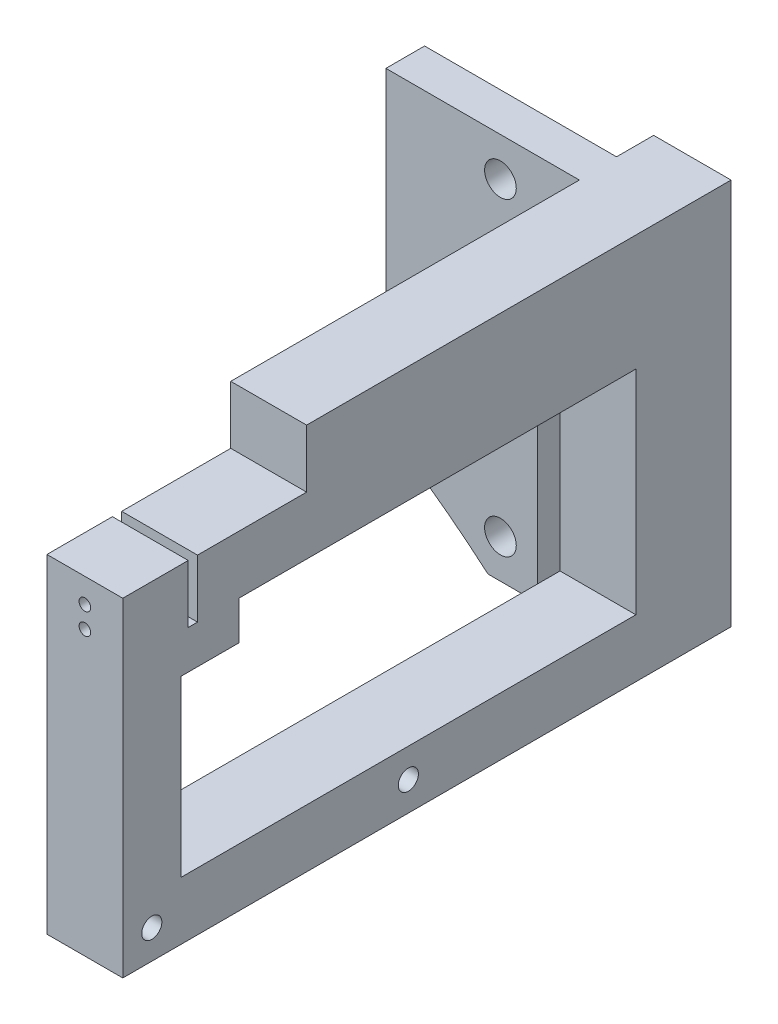
ISO-10303-21;
HEADER;
FILE_DESCRIPTION(('STEP AP214'),'2;1');
FILE_NAME('part.step','',(''),(''),'','','');
FILE_SCHEMA(('AUTOMOTIVE_DESIGN { 1 0 10303 214 1 1 1 1 }'));
ENDSEC;
DATA;
#1=APPLICATION_CONTEXT('core data for automotive mechanical design processes');
#2=APPLICATION_PROTOCOL_DEFINITION('international standard','automotive_design',2000,#1);
#3=PRODUCT_CONTEXT('',#1,'mechanical');
#4=PRODUCT('Part','Part','',(#3));
#5=PRODUCT_RELATED_PRODUCT_CATEGORY('part','',(#4));
#6=PRODUCT_DEFINITION_FORMATION('','',#4);
#7=PRODUCT_DEFINITION_CONTEXT('part definition',#1,'design');
#8=PRODUCT_DEFINITION('design','',#6,#7);
#9=PRODUCT_DEFINITION_SHAPE('','',#8);
#10=(LENGTH_UNIT() NAMED_UNIT(*) SI_UNIT(.MILLI.,.METRE.));
#11=(NAMED_UNIT(*) PLANE_ANGLE_UNIT() SI_UNIT($,.RADIAN.));
#12=(NAMED_UNIT(*) SI_UNIT($,.STERADIAN.) SOLID_ANGLE_UNIT());
#13=UNCERTAINTY_MEASURE_WITH_UNIT(LENGTH_MEASURE(1.E-05),#10,'distance_accuracy_value','');
#14=(GEOMETRIC_REPRESENTATION_CONTEXT(3) GLOBAL_UNCERTAINTY_ASSIGNED_CONTEXT((#13)) GLOBAL_UNIT_ASSIGNED_CONTEXT((#10,
#11,#12)) REPRESENTATION_CONTEXT('',''));
#15=CARTESIAN_POINT('',(0.,0.,0.));
#16=DIRECTION('',(0.,0.,1.));
#17=DIRECTION('',(1.,0.,0.));
#18=AXIS2_PLACEMENT_3D('',#15,#16,#17);
#19=CARTESIAN_POINT('',(-1.101953488478,22.225,0.));
#20=DIRECTION('',(0.,-1.,0.));
#21=DIRECTION('',(0.,0.,-1.));
#22=AXIS2_PLACEMENT_3D('',#19,#20,#21);
#23=PLANE('',#22);
#24=DIRECTION('',(-1.,0.,0.));
#25=VECTOR('',#24,1.);
#26=CARTESIAN_POINT('',(114.3,22.225,82.987000002));
#27=LINE('',#26,#25);
#28=CARTESIAN_POINT('',(114.3,22.225,82.987000002));
#29=VERTEX_POINT('',#28);
#30=CARTESIAN_POINT('',(101.854,22.225,82.987000002));
#31=VERTEX_POINT('',#30);
#32=EDGE_CURVE('E276',#29,#31,#27,.T.);
#33=ORIENTED_EDGE('',*,*,#32,.T.);
#34=DIRECTION('',(0.,0.,-1.));
#35=VECTOR('',#34,1.);
#36=CARTESIAN_POINT('',(101.854,22.225,0.));
#37=LINE('',#36,#35);
#38=CARTESIAN_POINT('',(101.854,22.225,93.725000002));
#39=VERTEX_POINT('',#38);
#40=EDGE_CURVE('E359',#39,#31,#37,.T.);
#41=ORIENTED_EDGE('',*,*,#40,.F.);
#42=DIRECTION('',(1.,0.,0.));
#43=VECTOR('',#42,1.);
#44=CARTESIAN_POINT('',(-1.101953488478,22.225,93.725000002));
#45=LINE('',#44,#43);
#46=CARTESIAN_POINT('',(114.3,22.225,93.725000002));
#47=VERTEX_POINT('',#46);
#48=EDGE_CURVE('E319',#39,#47,#45,.T.);
#49=ORIENTED_EDGE('',*,*,#48,.T.);
#50=DIRECTION('',(0.,0.,-1.));
#51=VECTOR('',#50,1.);
#52=CARTESIAN_POINT('',(114.3,22.225,0.));
#53=LINE('',#52,#51);
#54=EDGE_CURVE('E332',#47,#29,#53,.T.);
#55=ORIENTED_EDGE('',*,*,#54,.T.);
#56=EDGE_LOOP('',(#33,#41,#49,#55));
#57=FACE_BOUND('',#56,.T.);
#58=ADVANCED_FACE('F81',(#57),#23,.F.);
#59=CARTESIAN_POINT('',(-1.101953488478,12.7,0.));
#60=DIRECTION('',(0.,1.,0.));
#61=DIRECTION('',(0.,0.,1.));
#62=AXIS2_PLACEMENT_3D('',#59,#60,#61);
#63=PLANE('',#62);
#64=DIRECTION('',(1.,0.,0.));
#65=VECTOR('',#64,1.);
#66=CARTESIAN_POINT('',(-1.14790309600737,12.7,74.675000002));
#67=LINE('',#66,#65);
#68=CARTESIAN_POINT('',(101.854,12.7,74.675000002));
#69=VERTEX_POINT('',#68);
#70=CARTESIAN_POINT('',(114.3,12.7,74.675000002));
#71=VERTEX_POINT('',#70);
#72=EDGE_CURVE('E290',#69,#71,#67,.T.);
#73=ORIENTED_EDGE('',*,*,#72,.F.);
#74=DIRECTION('',(0.,0.,1.));
#75=VECTOR('',#74,1.);
#76=CARTESIAN_POINT('',(101.854,12.7,0.));
#77=LINE('',#76,#75);
#78=CARTESIAN_POINT('',(101.854,12.7,9.525));
#79=VERTEX_POINT('',#78);
#80=EDGE_CURVE('E352',#79,#69,#77,.T.);
#81=ORIENTED_EDGE('',*,*,#80,.F.);
#82=DIRECTION('',(1.,0.,0.));
#83=VECTOR('',#82,1.);
#84=CARTESIAN_POINT('',(-1.101953488478,12.7,9.525));
#85=LINE('',#84,#83);
#86=CARTESIAN_POINT('',(114.3,12.7,9.525));
#87=VERTEX_POINT('',#86);
#88=EDGE_CURVE('E340',#79,#87,#85,.T.);
#89=ORIENTED_EDGE('',*,*,#88,.T.);
#90=DIRECTION('',(0.,0.,1.));
#91=VECTOR('',#90,1.);
#92=CARTESIAN_POINT('',(114.3,12.7,0.));
#93=LINE('',#92,#91);
#94=EDGE_CURVE('E336',#87,#71,#93,.T.);
#95=ORIENTED_EDGE('',*,*,#94,.T.);
#96=EDGE_LOOP('',(#73,#81,#89,#95));
#97=FACE_BOUND('',#96,.T.);
#98=ADVANCED_FACE('F560',(#97),#63,.F.);
#99=CARTESIAN_POINT('',(0.,-132.08,6.35));
#100=DIRECTION('',(0.,0.,1.));
#101=DIRECTION('',(1.,0.,0.));
#102=AXIS2_PLACEMENT_3D('',#99,#100,#101);
#103=PLANE('',#102);
#104=CARTESIAN_POINT('',(88.9,-25.4,6.35));
#105=DIRECTION('',(0.,0.,1.));
#106=DIRECTION('',(1.,0.,0.));
#107=AXIS2_PLACEMENT_3D('',#104,#105,#106);
#108=CIRCLE('',#107,2.600000007);
#109=CARTESIAN_POINT('',(91.500000007,-25.4,6.35));
#110=VERTEX_POINT('',#109);
#111=EDGE_CURVE('E410',#110,#110,#108,.T.);
#112=ORIENTED_EDGE('',*,*,#111,.F.);
#113=EDGE_LOOP('',(#112));
#114=FACE_BOUND('',#113,.T.);
#115=CARTESIAN_POINT('',(88.9,25.4,6.35));
#116=DIRECTION('',(0.,0.,1.));
#117=DIRECTION('',(1.,0.,0.));
#118=AXIS2_PLACEMENT_3D('',#115,#116,#117);
#119=CIRCLE('',#118,2.600000007);
#120=CARTESIAN_POINT('',(91.500000007,25.4,6.35));
#121=VERTEX_POINT('',#120);
#122=EDGE_CURVE('E404',#121,#121,#119,.T.);
#123=ORIENTED_EDGE('',*,*,#122,.F.);
#124=EDGE_LOOP('',(#123));
#125=FACE_BOUND('',#124,.T.);
#126=DIRECTION('',(1.,0.,0.));
#127=VECTOR('',#126,1.);
#128=CARTESIAN_POINT('',(94.996,22.479,6.35));
#129=LINE('',#128,#127);
#130=CARTESIAN_POINT('',(94.996,22.479,6.35));
#131=VERTEX_POINT('',#130);
#132=CARTESIAN_POINT('',(101.854,22.479,6.35));
#133=VERTEX_POINT('',#132);
#134=EDGE_CURVE('E427',#131,#133,#129,.T.);
#135=ORIENTED_EDGE('',*,*,#134,.T.);
#136=DIRECTION('',(0.,-1.,0.));
#137=VECTOR('',#136,1.);
#138=CARTESIAN_POINT('',(101.854,90.3006026653769,6.35));
#139=LINE('',#138,#137);
#140=CARTESIAN_POINT('',(101.854,31.75,6.35));
#141=VERTEX_POINT('',#140);
#142=EDGE_CURVE('E322',#141,#133,#139,.T.);
#143=ORIENTED_EDGE('',*,*,#142,.F.);
#144=DIRECTION('',(-1.,0.,0.));
#145=VECTOR('',#144,1.);
#146=CARTESIAN_POINT('',(70.104,31.75,6.35));
#147=LINE('',#146,#145);
#148=CARTESIAN_POINT('',(70.104,31.75,6.35));
#149=VERTEX_POINT('',#148);
#150=EDGE_CURVE('E416',#141,#149,#147,.T.);
#151=ORIENTED_EDGE('',*,*,#150,.T.);
#152=DIRECTION('',(0.,-1.,0.));
#153=VECTOR('',#152,1.);
#154=CARTESIAN_POINT('',(70.104,22.225,6.35));
#155=LINE('',#154,#153);
#156=CARTESIAN_POINT('',(70.104,-19.4100401501921,6.35));
#157=VERTEX_POINT('',#156);
#158=EDGE_CURVE('E418',#149,#157,#155,.T.);
#159=ORIENTED_EDGE('',*,*,#158,.T.);
#160=CARTESIAN_POINT('',(0.,-132.08,6.35));
#161=DIRECTION('',(0.,0.,-1.));
#162=DIRECTION('',(1.,0.,0.));
#163=AXIS2_PLACEMENT_3D('',#160,#161,#162);
#164=CIRCLE('',#163,132.699248937427);
#165=CARTESIAN_POINT('',(86.8503412115192,-31.75,6.35));
#166=VERTEX_POINT('',#165);
#167=EDGE_CURVE('E421',#157,#166,#164,.T.);
#168=ORIENTED_EDGE('',*,*,#167,.T.);
#169=DIRECTION('',(1.,0.,0.));
#170=VECTOR('',#169,1.);
#171=CARTESIAN_POINT('',(94.996,-31.75,6.35));
#172=LINE('',#171,#170);
#173=CARTESIAN_POINT('',(94.996,-31.75,6.35));
#174=VERTEX_POINT('',#173);
#175=EDGE_CURVE('E423',#166,#174,#172,.T.);
#176=ORIENTED_EDGE('',*,*,#175,.T.);
#177=DIRECTION('',(0.,1.,0.));
#178=VECTOR('',#177,1.);
#179=CARTESIAN_POINT('',(94.996,-31.75,6.35));
#180=LINE('',#179,#178);
#181=EDGE_CURVE('E425',#174,#131,#180,.T.);
#182=ORIENTED_EDGE('',*,*,#181,.T.);
#183=EDGE_LOOP('',(#135,#143,#151,#159,#168,#176,#182));
#184=FACE_BOUND('',#183,.T.);
#185=ADVANCED_FACE('F509',(#114,#125,#184),#103,.T.);
#186=CARTESIAN_POINT('',(101.854,22.225,81.463000002));
#187=VERTEX_POINT('',#186);
#188=CARTESIAN_POINT('',(101.854,22.225,63.562500002));
#189=VERTEX_POINT('',#188);
#190=EDGE_CURVE('E362',#187,#189,#37,.T.);
#191=ORIENTED_EDGE('',*,*,#190,.F.);
#192=DIRECTION('',(-1.,0.,0.));
#193=VECTOR('',#192,1.);
#194=CARTESIAN_POINT('',(114.3,22.225,81.463000002));
#195=LINE('',#194,#193);
#196=CARTESIAN_POINT('',(114.3,22.225,81.463000002));
#197=VERTEX_POINT('',#196);
#198=EDGE_CURVE('E273',#197,#187,#195,.T.);
#199=ORIENTED_EDGE('',*,*,#198,.F.);
#200=CARTESIAN_POINT('',(114.3,22.225,63.562500002));
#201=VERTEX_POINT('',#200);
#202=EDGE_CURVE('E264',#197,#201,#53,.T.);
#203=ORIENTED_EDGE('',*,*,#202,.T.);
#204=DIRECTION('',(1.,0.,0.));
#205=VECTOR('',#204,1.);
#206=CARTESIAN_POINT('',(101.854,22.225,63.562500002));
#207=LINE('',#206,#205);
#208=EDGE_CURVE('E312',#189,#201,#207,.T.);
#209=ORIENTED_EDGE('',*,*,#208,.F.);
#210=EDGE_LOOP('',(#191,#199,#203,#209));
#211=FACE_BOUND('',#210,.T.);
#212=ADVANCED_FACE('F506',(#211),#23,.F.);
#213=CARTESIAN_POINT('',(0.,-132.08,0.));
#214=DIRECTION('',(0.,0.,1.));
#215=DIRECTION('',(1.,0.,0.));
#216=AXIS2_PLACEMENT_3D('',#213,#214,#215);
#217=PLANE('',#216);
#218=DIRECTION('',(-1.,0.,0.));
#219=VECTOR('',#218,1.);
#220=CARTESIAN_POINT('',(70.104,31.75,0.));
#221=LINE('',#220,#219);
#222=CARTESIAN_POINT('',(101.6,31.75,0.));
#223=VERTEX_POINT('',#222);
#224=CARTESIAN_POINT('',(70.104,31.75,0.));
#225=VERTEX_POINT('',#224);
#226=EDGE_CURVE('E413',#223,#225,#221,.T.);
#227=ORIENTED_EDGE('',*,*,#226,.F.);
#228=DIRECTION('',(0.,1.,0.));
#229=VECTOR('',#228,1.);
#230=CARTESIAN_POINT('',(101.6,22.479,0.));
#231=LINE('',#230,#229);
#232=CARTESIAN_POINT('',(101.6,22.479,0.));
#233=VERTEX_POINT('',#232);
#234=EDGE_CURVE('E419',#233,#223,#231,.T.);
#235=ORIENTED_EDGE('',*,*,#234,.F.);
#236=DIRECTION('',(1.,0.,0.));
#237=VECTOR('',#236,1.);
#238=CARTESIAN_POINT('',(94.996,22.479,0.));
#239=LINE('',#238,#237);
#240=CARTESIAN_POINT('',(94.996,22.479,0.));
#241=VERTEX_POINT('',#240);
#242=EDGE_CURVE('E441',#241,#233,#239,.T.);
#243=ORIENTED_EDGE('',*,*,#242,.F.);
#244=DIRECTION('',(0.,1.,0.));
#245=VECTOR('',#244,1.);
#246=CARTESIAN_POINT('',(94.996,-31.75,0.));
#247=LINE('',#246,#245);
#248=CARTESIAN_POINT('',(94.996,-31.75,0.));
#249=VERTEX_POINT('',#248);
#250=EDGE_CURVE('E439',#249,#241,#247,.T.);
#251=ORIENTED_EDGE('',*,*,#250,.F.);
#252=DIRECTION('',(1.,0.,0.));
#253=VECTOR('',#252,1.);
#254=CARTESIAN_POINT('',(94.996,-31.75,0.));
#255=LINE('',#254,#253);
#256=CARTESIAN_POINT('',(86.8503412115192,-31.75,0.));
#257=VERTEX_POINT('',#256);
#258=EDGE_CURVE('E437',#257,#249,#255,.T.);
#259=ORIENTED_EDGE('',*,*,#258,.F.);
#260=CARTESIAN_POINT('',(0.,-132.08,0.));
#261=DIRECTION('',(0.,0.,-1.));
#262=DIRECTION('',(1.,0.,0.));
#263=AXIS2_PLACEMENT_3D('',#260,#261,#262);
#264=CIRCLE('',#263,132.699248937427);
#265=CARTESIAN_POINT('',(70.104,-19.4100401501921,0.));
#266=VERTEX_POINT('',#265);
#267=EDGE_CURVE('E435',#266,#257,#264,.T.);
#268=ORIENTED_EDGE('',*,*,#267,.F.);
#269=DIRECTION('',(0.,-1.,0.));
#270=VECTOR('',#269,1.);
#271=CARTESIAN_POINT('',(70.104,-19.2523962473841,0.));
#272=LINE('',#271,#270);
#273=EDGE_CURVE('E433',#225,#266,#272,.T.);
#274=ORIENTED_EDGE('',*,*,#273,.F.);
#275=EDGE_LOOP('',(#227,#235,#243,#251,#259,#268,#274));
#276=FACE_BOUND('',#275,.T.);
#277=CARTESIAN_POINT('',(88.9,-25.4,0.));
#278=DIRECTION('',(0.,0.,1.));
#279=DIRECTION('',(1.,0.,0.));
#280=AXIS2_PLACEMENT_3D('',#277,#278,#279);
#281=CIRCLE('',#280,2.600000007);
#282=CARTESIAN_POINT('',(91.500000007,-25.4,0.));
#283=VERTEX_POINT('',#282);
#284=EDGE_CURVE('E407',#283,#283,#281,.T.);
#285=ORIENTED_EDGE('',*,*,#284,.T.);
#286=EDGE_LOOP('',(#285));
#287=FACE_BOUND('',#286,.T.);
#288=CARTESIAN_POINT('',(88.9,25.4,0.));
#289=DIRECTION('',(0.,0.,1.));
#290=DIRECTION('',(1.,0.,0.));
#291=AXIS2_PLACEMENT_3D('',#288,#289,#290);
#292=CIRCLE('',#291,2.600000007);
#293=CARTESIAN_POINT('',(91.500000007,25.4,0.));
#294=VERTEX_POINT('',#293);
#295=EDGE_CURVE('E403',#294,#294,#292,.T.);
#296=ORIENTED_EDGE('',*,*,#295,.T.);
#297=EDGE_LOOP('',(#296));
#298=FACE_BOUND('',#297,.T.);
#299=ADVANCED_FACE('F539',(#276,#287,#298),#217,.F.);
#300=CARTESIAN_POINT('',(70.104,31.75,6.35));
#301=DIRECTION('',(0.,-1.,0.));
#302=DIRECTION('',(0.,0.,-1.));
#303=AXIS2_PLACEMENT_3D('',#300,#301,#302);
#304=PLANE('',#303);
#305=ORIENTED_EDGE('',*,*,#150,.F.);
#306=DIRECTION('',(0.,0.,-1.));
#307=VECTOR('',#306,1.);
#308=CARTESIAN_POINT('',(101.854,31.75,6.35));
#309=LINE('',#308,#307);
#310=CARTESIAN_POINT('',(101.854,31.75,63.562500002));
#311=VERTEX_POINT('',#310);
#312=EDGE_CURVE('E316',#311,#141,#309,.T.);
#313=ORIENTED_EDGE('',*,*,#312,.F.);
#314=DIRECTION('',(-1.,0.,0.));
#315=VECTOR('',#314,1.);
#316=CARTESIAN_POINT('',(101.854,31.75,63.562500002));
#317=LINE('',#316,#315);
#318=CARTESIAN_POINT('',(114.3,31.75,63.562500002));
#319=VERTEX_POINT('',#318);
#320=EDGE_CURVE('E313',#319,#311,#317,.T.);
#321=ORIENTED_EDGE('',*,*,#320,.F.);
#322=DIRECTION('',(0.,0.,1.));
#323=VECTOR('',#322,1.);
#324=CARTESIAN_POINT('',(114.3,31.75,-71.1075478226285));
#325=LINE('',#324,#323);
#326=CARTESIAN_POINT('',(114.3,31.75,-6.09600000000007));
#327=VERTEX_POINT('',#326);
#328=EDGE_CURVE('E384',#327,#319,#325,.T.);
#329=ORIENTED_EDGE('',*,*,#328,.F.);
#330=DIRECTION('',(-1.,0.,0.));
#331=VECTOR('',#330,1.);
#332=CARTESIAN_POINT('',(114.3,31.75,-6.09600000000007));
#333=LINE('',#332,#331);
#334=CARTESIAN_POINT('',(101.6,31.75,-6.09600000000006));
#335=VERTEX_POINT('',#334);
#336=EDGE_CURVE('E382',#327,#335,#333,.T.);
#337=ORIENTED_EDGE('',*,*,#336,.T.);
#338=DIRECTION('',(0.,0.,1.));
#339=VECTOR('',#338,1.);
#340=CARTESIAN_POINT('',(101.6,31.75,-71.1075478226285));
#341=LINE('',#340,#339);
#342=EDGE_CURVE('E381',#335,#223,#341,.T.);
#343=ORIENTED_EDGE('',*,*,#342,.T.);
#344=ORIENTED_EDGE('',*,*,#226,.T.);
#345=DIRECTION('',(0.,0.,-1.));
#346=VECTOR('',#345,1.);
#347=CARTESIAN_POINT('',(70.104,31.75,6.35));
#348=LINE('',#347,#346);
#349=EDGE_CURVE('E13',#149,#225,#348,.T.);
#350=ORIENTED_EDGE('',*,*,#349,.F.);
#351=EDGE_LOOP('',(#305,#313,#321,#329,#337,#343,#344,#350));
#352=FACE_BOUND('',#351,.T.);
#353=ADVANCED_FACE('F83',(#352),#304,.F.);
#354=CARTESIAN_POINT('',(70.104,-19.2523962473841,6.35));
#355=DIRECTION('',(1.,0.,0.));
#356=DIRECTION('',(0.,1.,0.));
#357=AXIS2_PLACEMENT_3D('',#354,#355,#356);
#358=PLANE('',#357);
#359=ORIENTED_EDGE('',*,*,#273,.T.);
#360=DIRECTION('',(0.,0.,-1.));
#361=VECTOR('',#360,1.);
#362=CARTESIAN_POINT('',(70.104,-19.4100401501921,6.35));
#363=LINE('',#362,#361);
#364=EDGE_CURVE('E90',#157,#266,#363,.T.);
#365=ORIENTED_EDGE('',*,*,#364,.F.);
#366=ORIENTED_EDGE('',*,*,#158,.F.);
#367=ORIENTED_EDGE('',*,*,#349,.T.);
#368=EDGE_LOOP('',(#359,#365,#366,#367));
#369=FACE_BOUND('',#368,.T.);
#370=ADVANCED_FACE('F514',(#369),#358,.F.);
#371=CARTESIAN_POINT('',(0.,-132.08,6.35));
#372=DIRECTION('',(0.,0.,-1.));
#373=DIRECTION('',(-1.,0.,0.));
#374=AXIS2_PLACEMENT_3D('',#371,#372,#373);
#375=CYLINDRICAL_SURFACE('',#374,132.699248937427);
#376=ORIENTED_EDGE('',*,*,#267,.T.);
#377=DIRECTION('',(0.,0.,-1.));
#378=VECTOR('',#377,1.);
#379=CARTESIAN_POINT('',(86.8503412115192,-31.75,6.35));
#380=LINE('',#379,#378);
#381=EDGE_CURVE('E450',#166,#257,#380,.T.);
#382=ORIENTED_EDGE('',*,*,#381,.F.);
#383=ORIENTED_EDGE('',*,*,#167,.F.);
#384=ORIENTED_EDGE('',*,*,#364,.T.);
#385=EDGE_LOOP('',(#376,#382,#383,#384));
#386=FACE_BOUND('',#385,.T.);
#387=ADVANCED_FACE('F521',(#386),#375,.F.);
#388=CARTESIAN_POINT('',(94.996,-31.75,6.35));
#389=DIRECTION('',(0.,1.,0.));
#390=DIRECTION('',(0.,0.,1.));
#391=AXIS2_PLACEMENT_3D('',#388,#389,#390);
#392=PLANE('',#391);
#393=ORIENTED_EDGE('',*,*,#258,.T.);
#394=DIRECTION('',(0.,0.,-1.));
#395=VECTOR('',#394,1.);
#396=CARTESIAN_POINT('',(94.996,-31.75,6.35));
#397=LINE('',#396,#395);
#398=EDGE_CURVE('E447',#174,#249,#397,.T.);
#399=ORIENTED_EDGE('',*,*,#398,.F.);
#400=ORIENTED_EDGE('',*,*,#175,.F.);
#401=ORIENTED_EDGE('',*,*,#381,.T.);
#402=EDGE_LOOP('',(#393,#399,#400,#401));
#403=FACE_BOUND('',#402,.T.);
#404=ADVANCED_FACE('F525',(#403),#392,.F.);
#405=CARTESIAN_POINT('',(94.996,-31.75,6.35));
#406=DIRECTION('',(-1.,0.,0.));
#407=DIRECTION('',(0.,-1.,0.));
#408=AXIS2_PLACEMENT_3D('',#405,#406,#407);
#409=PLANE('',#408);
#410=ORIENTED_EDGE('',*,*,#250,.T.);
#411=DIRECTION('',(0.,0.,-1.));
#412=VECTOR('',#411,1.);
#413=CARTESIAN_POINT('',(94.996,22.479,6.35));
#414=LINE('',#413,#412);
#415=EDGE_CURVE('E430',#131,#241,#414,.T.);
#416=ORIENTED_EDGE('',*,*,#415,.F.);
#417=ORIENTED_EDGE('',*,*,#181,.F.);
#418=ORIENTED_EDGE('',*,*,#398,.T.);
#419=EDGE_LOOP('',(#410,#416,#417,#418));
#420=FACE_BOUND('',#419,.T.);
#421=ADVANCED_FACE('F530',(#420),#409,.F.);
#422=CARTESIAN_POINT('',(94.996,22.479,6.35));
#423=DIRECTION('',(0.,1.,0.));
#424=DIRECTION('',(0.,0.,1.));
#425=AXIS2_PLACEMENT_3D('',#422,#423,#424);
#426=PLANE('',#425);
#427=ORIENTED_EDGE('',*,*,#242,.T.);
#428=DIRECTION('',(0.,0.,1.));
#429=VECTOR('',#428,1.);
#430=CARTESIAN_POINT('',(101.6,22.479,-71.1075478226285));
#431=LINE('',#430,#429);
#432=CARTESIAN_POINT('',(101.6,22.479,-6.09600000000006));
#433=VERTEX_POINT('',#432);
#434=EDGE_CURVE('E380',#433,#233,#431,.T.);
#435=ORIENTED_EDGE('',*,*,#434,.F.);
#436=DIRECTION('',(1.,0.,0.));
#437=VECTOR('',#436,1.);
#438=CARTESIAN_POINT('',(101.6,22.479,-6.09600000000006));
#439=LINE('',#438,#437);
#440=CARTESIAN_POINT('',(101.854,22.479,-6.09600000000009));
#441=VERTEX_POINT('',#440);
#442=EDGE_CURVE('E351',#433,#441,#439,.T.);
#443=ORIENTED_EDGE('',*,*,#442,.T.);
#444=DIRECTION('',(0.,0.,1.));
#445=VECTOR('',#444,1.);
#446=CARTESIAN_POINT('',(101.854,22.479,-71.1075478226285));
#447=LINE('',#446,#445);
#448=EDGE_CURVE('E376',#441,#133,#447,.T.);
#449=ORIENTED_EDGE('',*,*,#448,.T.);
#450=ORIENTED_EDGE('',*,*,#134,.F.);
#451=ORIENTED_EDGE('',*,*,#415,.T.);
#452=EDGE_LOOP('',(#427,#435,#443,#449,#450,#451));
#453=FACE_BOUND('',#452,.T.);
#454=ADVANCED_FACE('F533',(#453),#426,.F.);
#455=CARTESIAN_POINT('',(88.9,-25.4,6.35));
#456=DIRECTION('',(0.,0.,-1.));
#457=DIRECTION('',(-1.,0.,0.));
#458=AXIS2_PLACEMENT_3D('',#455,#456,#457);
#459=CYLINDRICAL_SURFACE('',#458,2.600000007);
#460=ORIENTED_EDGE('',*,*,#111,.T.);
#461=EDGE_LOOP('',(#460));
#462=FACE_BOUND('',#461,.T.);
#463=ORIENTED_EDGE('',*,*,#284,.F.);
#464=EDGE_LOOP('',(#463));
#465=FACE_BOUND('',#464,.T.);
#466=ADVANCED_FACE('F549',(#462,#465),#459,.F.);
#467=CARTESIAN_POINT('',(88.9,25.4,6.35));
#468=DIRECTION('',(0.,0.,-1.));
#469=DIRECTION('',(-1.,0.,0.));
#470=AXIS2_PLACEMENT_3D('',#467,#468,#469);
#471=CYLINDRICAL_SURFACE('',#470,2.600000007);
#472=ORIENTED_EDGE('',*,*,#122,.T.);
#473=EDGE_LOOP('',(#472));
#474=FACE_BOUND('',#473,.T.);
#475=ORIENTED_EDGE('',*,*,#295,.F.);
#476=EDGE_LOOP('',(#475));
#477=FACE_BOUND('',#476,.T.);
#478=ADVANCED_FACE('F547',(#474,#477),#471,.F.);
#479=CARTESIAN_POINT('',(0.,-120.65,-6.09599999999997));
#480=DIRECTION('',(0.,0.,-1.));
#481=DIRECTION('',(1.,0.,0.));
#482=AXIS2_PLACEMENT_3D('',#479,#480,#481);
#483=PLANE('',#482);
#484=DIRECTION('',(1.,0.,0.));
#485=VECTOR('',#484,1.);
#486=CARTESIAN_POINT('',(101.854,-31.75,-6.09600000000006));
#487=LINE('',#486,#485);
#488=CARTESIAN_POINT('',(101.854,-31.75,-6.09600000000006));
#489=VERTEX_POINT('',#488);
#490=CARTESIAN_POINT('',(114.3,-31.75,-6.09600000000007));
#491=VERTEX_POINT('',#490);
#492=EDGE_CURVE('E388',#489,#491,#487,.T.);
#493=ORIENTED_EDGE('',*,*,#492,.F.);
#494=DIRECTION('',(0.,-1.,0.));
#495=VECTOR('',#494,1.);
#496=CARTESIAN_POINT('',(101.854,22.479,-6.09600000000006));
#497=LINE('',#496,#495);
#498=EDGE_CURVE('E392',#441,#489,#497,.T.);
#499=ORIENTED_EDGE('',*,*,#498,.F.);
#500=ORIENTED_EDGE('',*,*,#442,.F.);
#501=DIRECTION('',(0.,-1.,0.));
#502=VECTOR('',#501,1.);
#503=CARTESIAN_POINT('',(101.6,31.75,-6.09600000000006));
#504=LINE('',#503,#502);
#505=EDGE_CURVE('E377',#335,#433,#504,.T.);
#506=ORIENTED_EDGE('',*,*,#505,.F.);
#507=ORIENTED_EDGE('',*,*,#336,.F.);
#508=DIRECTION('',(0.,1.,0.));
#509=VECTOR('',#508,1.);
#510=CARTESIAN_POINT('',(114.3,-31.75,-6.09600000000007));
#511=LINE('',#510,#509);
#512=EDGE_CURVE('E385',#491,#327,#511,.T.);
#513=ORIENTED_EDGE('',*,*,#512,.F.);
#514=EDGE_LOOP('',(#493,#499,#500,#506,#507,#513));
#515=FACE_BOUND('',#514,.T.);
#516=ADVANCED_FACE('F496',(#515),#483,.T.);
#517=CARTESIAN_POINT('',(101.854,22.479,-71.1075478226285));
#518=DIRECTION('',(-1.,0.,0.));
#519=DIRECTION('',(0.,0.,1.));
#520=AXIS2_PLACEMENT_3D('',#517,#518,#519);
#521=PLANE('',#520);
#522=DIRECTION('',(0.,-1.,0.));
#523=VECTOR('',#522,1.);
#524=CARTESIAN_POINT('',(101.854,22.479,81.463000002));
#525=LINE('',#524,#523);
#526=CARTESIAN_POINT('',(101.854,12.7,81.463000002));
#527=VERTEX_POINT('',#526);
#528=EDGE_CURVE('E258',#187,#527,#525,.T.);
#529=ORIENTED_EDGE('',*,*,#528,.F.);
#530=ORIENTED_EDGE('',*,*,#190,.T.);
#531=DIRECTION('',(0.,-1.,0.));
#532=VECTOR('',#531,1.);
#533=CARTESIAN_POINT('',(101.854,90.3006026653769,63.562500002));
#534=LINE('',#533,#532);
#535=EDGE_CURVE('E317',#311,#189,#534,.T.);
#536=ORIENTED_EDGE('',*,*,#535,.F.);
#537=ORIENTED_EDGE('',*,*,#312,.T.);
#538=ORIENTED_EDGE('',*,*,#142,.T.);
#539=ORIENTED_EDGE('',*,*,#448,.F.);
#540=ORIENTED_EDGE('',*,*,#498,.T.);
#541=DIRECTION('',(0.,0.,1.));
#542=VECTOR('',#541,1.);
#543=CARTESIAN_POINT('',(101.854,-31.75,-71.1075478226285));
#544=LINE('',#543,#542);
#545=CARTESIAN_POINT('',(101.854,-31.75,93.725000002));
#546=VERTEX_POINT('',#545);
#547=EDGE_CURVE('E391',#489,#546,#544,.T.);
#548=ORIENTED_EDGE('',*,*,#547,.T.);
#549=DIRECTION('',(0.,1.,0.));
#550=VECTOR('',#549,1.);
#551=CARTESIAN_POINT('',(101.854,0.,93.725000002));
#552=LINE('',#551,#550);
#553=EDGE_CURVE('E330',#546,#39,#552,.T.);
#554=ORIENTED_EDGE('',*,*,#553,.T.);
#555=ORIENTED_EDGE('',*,*,#40,.T.);
#556=DIRECTION('',(0.,-1.,0.));
#557=VECTOR('',#556,1.);
#558=CARTESIAN_POINT('',(101.854,22.479,82.987000002));
#559=LINE('',#558,#557);
#560=CARTESIAN_POINT('',(101.854,12.7,82.987000002));
#561=VERTEX_POINT('',#560);
#562=EDGE_CURVE('E281',#31,#561,#559,.T.);
#563=ORIENTED_EDGE('',*,*,#562,.T.);
#564=DIRECTION('',(0.,0.,-1.));
#565=VECTOR('',#564,1.);
#566=CARTESIAN_POINT('',(101.854,12.7,-71.1075478226285));
#567=LINE('',#566,#565);
#568=EDGE_CURVE('E275',#561,#527,#567,.T.);
#569=ORIENTED_EDGE('',*,*,#568,.T.);
#570=EDGE_LOOP('',(#529,#530,#536,#537,#538,#539,#540,#548,#554,#555,#563,#569));
#571=FACE_BOUND('',#570,.T.);
#572=DIRECTION('',(0.,0.,-1.));
#573=VECTOR('',#572,1.);
#574=CARTESIAN_POINT('',(101.854,6.35000000000002,0.));
#575=LINE('',#574,#573);
#576=CARTESIAN_POINT('',(101.854,6.35000000000002,84.200000002));
#577=VERTEX_POINT('',#576);
#578=CARTESIAN_POINT('',(101.854,6.35000000000002,74.675000002));
#579=VERTEX_POINT('',#578);
#580=EDGE_CURVE('E292',#577,#579,#575,.T.);
#581=ORIENTED_EDGE('',*,*,#580,.F.);
#582=DIRECTION('',(0.,-1.,0.));
#583=VECTOR('',#582,1.);
#584=CARTESIAN_POINT('',(101.854,0.,84.200000002));
#585=LINE('',#584,#583);
#586=CARTESIAN_POINT('',(101.854,-22.225,84.200000002));
#587=VERTEX_POINT('',#586);
#588=EDGE_CURVE('E349',#577,#587,#585,.T.);
#589=ORIENTED_EDGE('',*,*,#588,.T.);
#590=DIRECTION('',(0.,0.,-1.));
#591=VECTOR('',#590,1.);
#592=CARTESIAN_POINT('',(101.854,-22.225,0.));
#593=LINE('',#592,#591);
#594=CARTESIAN_POINT('',(101.854,-22.225,9.525));
#595=VERTEX_POINT('',#594);
#596=EDGE_CURVE('E358',#587,#595,#593,.T.);
#597=ORIENTED_EDGE('',*,*,#596,.T.);
#598=DIRECTION('',(0.,1.,0.));
#599=VECTOR('',#598,1.);
#600=CARTESIAN_POINT('',(101.854,0.,9.525));
#601=LINE('',#600,#599);
#602=EDGE_CURVE('E355',#595,#79,#601,.T.);
#603=ORIENTED_EDGE('',*,*,#602,.T.);
#604=ORIENTED_EDGE('',*,*,#80,.T.);
#605=DIRECTION('',(0.,-1.,0.));
#606=VECTOR('',#605,1.);
#607=CARTESIAN_POINT('',(101.854,0.,74.675000002));
#608=LINE('',#607,#606);
#609=EDGE_CURVE('E285',#69,#579,#608,.T.);
#610=ORIENTED_EDGE('',*,*,#609,.T.);
#611=EDGE_LOOP('',(#581,#589,#597,#603,#604,#610));
#612=FACE_BOUND('',#611,.T.);
#613=CARTESIAN_POINT('',(101.854,-26.9875,88.962500002));
#614=DIRECTION('',(-1.,0.,0.));
#615=DIRECTION('',(0.,0.,1.));
#616=AXIS2_PLACEMENT_3D('',#613,#614,#615);
#617=CIRCLE('',#616,1.650000002);
#618=CARTESIAN_POINT('',(101.854,-26.9875,90.612500004));
#619=VERTEX_POINT('',#618);
#620=EDGE_CURVE('E309',#619,#619,#617,.T.);
#621=ORIENTED_EDGE('',*,*,#620,.F.);
#622=EDGE_LOOP('',(#621));
#623=FACE_BOUND('',#622,.T.);
#624=CARTESIAN_POINT('',(101.854,-26.9875,46.862500001));
#625=DIRECTION('',(-1.,0.,0.));
#626=DIRECTION('',(0.,0.,1.));
#627=AXIS2_PLACEMENT_3D('',#624,#625,#626);
#628=CIRCLE('',#627,1.650000002);
#629=CARTESIAN_POINT('',(101.854,-26.9875,48.512500003));
#630=VERTEX_POINT('',#629);
#631=EDGE_CURVE('E304',#630,#630,#628,.T.);
#632=ORIENTED_EDGE('',*,*,#631,.F.);
#633=EDGE_LOOP('',(#632));
#634=FACE_BOUND('',#633,.T.);
#635=ADVANCED_FACE('F484',(#571,#612,#623,#634),#521,.T.);
#636=CARTESIAN_POINT('',(101.854,-31.75,-71.1075478226285));
#637=DIRECTION('',(0.,-1.,0.));
#638=DIRECTION('',(0.,0.,-1.));
#639=AXIS2_PLACEMENT_3D('',#636,#637,#638);
#640=PLANE('',#639);
#641=ORIENTED_EDGE('',*,*,#547,.F.);
#642=ORIENTED_EDGE('',*,*,#492,.T.);
#643=DIRECTION('',(0.,0.,1.));
#644=VECTOR('',#643,1.);
#645=CARTESIAN_POINT('',(114.3,-31.75,-71.1075478226285));
#646=LINE('',#645,#644);
#647=CARTESIAN_POINT('',(114.3,-31.75,93.725000002));
#648=VERTEX_POINT('',#647);
#649=EDGE_CURVE('E387',#491,#648,#646,.T.);
#650=ORIENTED_EDGE('',*,*,#649,.T.);
#651=DIRECTION('',(1.,0.,0.));
#652=VECTOR('',#651,1.);
#653=CARTESIAN_POINT('',(-1.101953488478,-31.75,93.725000002));
#654=LINE('',#653,#652);
#655=EDGE_CURVE('E331',#546,#648,#654,.T.);
#656=ORIENTED_EDGE('',*,*,#655,.F.);
#657=EDGE_LOOP('',(#641,#642,#650,#656));
#658=FACE_BOUND('',#657,.T.);
#659=ADVANCED_FACE('F490',(#658),#640,.T.);
#660=CARTESIAN_POINT('',(114.3,-31.75,-71.1075478226285));
#661=DIRECTION('',(1.,0.,0.));
#662=DIRECTION('',(0.,0.,-1.));
#663=AXIS2_PLACEMENT_3D('',#660,#661,#662);
#664=PLANE('',#663);
#665=DIRECTION('',(0.,1.,0.));
#666=VECTOR('',#665,1.);
#667=CARTESIAN_POINT('',(114.3,22.225,81.463000002));
#668=LINE('',#667,#666);
#669=CARTESIAN_POINT('',(114.3,12.7,81.463000002));
#670=VERTEX_POINT('',#669);
#671=EDGE_CURVE('E252',#197,#670,#668,.F.);
#672=ORIENTED_EDGE('',*,*,#671,.T.);
#673=DIRECTION('',(0.,0.,-1.));
#674=VECTOR('',#673,1.);
#675=CARTESIAN_POINT('',(114.3,12.7,82.987000002));
#676=LINE('',#675,#674);
#677=CARTESIAN_POINT('',(114.3,12.7,82.987000002));
#678=VERTEX_POINT('',#677);
#679=EDGE_CURVE('E243',#678,#670,#676,.T.);
#680=ORIENTED_EDGE('',*,*,#679,.F.);
#681=DIRECTION('',(0.,1.,0.));
#682=VECTOR('',#681,1.);
#683=CARTESIAN_POINT('',(114.3,22.225,82.987000002));
#684=LINE('',#683,#682);
#685=EDGE_CURVE('E251',#29,#678,#684,.F.);
#686=ORIENTED_EDGE('',*,*,#685,.F.);
#687=ORIENTED_EDGE('',*,*,#54,.F.);
#688=DIRECTION('',(0.,1.,0.));
#689=VECTOR('',#688,1.);
#690=CARTESIAN_POINT('',(114.3,0.,93.725000002));
#691=LINE('',#690,#689);
#692=EDGE_CURVE('E328',#648,#47,#691,.T.);
#693=ORIENTED_EDGE('',*,*,#692,.F.);
#694=ORIENTED_EDGE('',*,*,#649,.F.);
#695=ORIENTED_EDGE('',*,*,#512,.T.);
#696=ORIENTED_EDGE('',*,*,#328,.T.);
#697=DIRECTION('',(0.,-1.,0.));
#698=VECTOR('',#697,1.);
#699=CARTESIAN_POINT('',(114.3,90.3006026653769,63.562500002));
#700=LINE('',#699,#698);
#701=EDGE_CURVE('E324',#319,#201,#700,.T.);
#702=ORIENTED_EDGE('',*,*,#701,.T.);
#703=ORIENTED_EDGE('',*,*,#202,.F.);
#704=EDGE_LOOP('',(#672,#680,#686,#687,#693,#694,#695,#696,#702,#703));
#705=FACE_BOUND('',#704,.T.);
#706=DIRECTION('',(0.,-1.,0.));
#707=VECTOR('',#706,1.);
#708=CARTESIAN_POINT('',(114.3,0.,84.200000002));
#709=LINE('',#708,#707);
#710=CARTESIAN_POINT('',(114.3,6.35000000000002,84.200000002));
#711=VERTEX_POINT('',#710);
#712=CARTESIAN_POINT('',(114.3,-22.225,84.200000002));
#713=VERTEX_POINT('',#712);
#714=EDGE_CURVE('E339',#711,#713,#709,.T.);
#715=ORIENTED_EDGE('',*,*,#714,.F.);
#716=DIRECTION('',(0.,0.,-1.));
#717=VECTOR('',#716,1.);
#718=CARTESIAN_POINT('',(114.3,6.35000000000002,0.));
#719=LINE('',#718,#717);
#720=CARTESIAN_POINT('',(114.3,6.35000000000002,74.675000002));
#721=VERTEX_POINT('',#720);
#722=EDGE_CURVE('E106',#711,#721,#719,.T.);
#723=ORIENTED_EDGE('',*,*,#722,.T.);
#724=DIRECTION('',(0.,-1.,0.));
#725=VECTOR('',#724,1.);
#726=CARTESIAN_POINT('',(114.3,0.,74.675000002));
#727=LINE('',#726,#725);
#728=EDGE_CURVE('E286',#71,#721,#727,.T.);
#729=ORIENTED_EDGE('',*,*,#728,.F.);
#730=ORIENTED_EDGE('',*,*,#94,.F.);
#731=DIRECTION('',(0.,1.,0.));
#732=VECTOR('',#731,1.);
#733=CARTESIAN_POINT('',(114.3,0.,9.525));
#734=LINE('',#733,#732);
#735=CARTESIAN_POINT('',(114.3,-22.225,9.525));
#736=VERTEX_POINT('',#735);
#737=EDGE_CURVE('E346',#736,#87,#734,.T.);
#738=ORIENTED_EDGE('',*,*,#737,.F.);
#739=DIRECTION('',(0.,0.,-1.));
#740=VECTOR('',#739,1.);
#741=CARTESIAN_POINT('',(114.3,-22.225,0.));
#742=LINE('',#741,#740);
#743=EDGE_CURVE('E343',#713,#736,#742,.T.);
#744=ORIENTED_EDGE('',*,*,#743,.F.);
#745=EDGE_LOOP('',(#715,#723,#729,#730,#738,#744));
#746=FACE_BOUND('',#745,.T.);
#747=CARTESIAN_POINT('',(114.3,-26.9875,88.962500002));
#748=DIRECTION('',(1.,0.,0.));
#749=DIRECTION('',(0.,0.,-1.));
#750=AXIS2_PLACEMENT_3D('',#747,#748,#749);
#751=CIRCLE('',#750,1.650000002);
#752=CARTESIAN_POINT('',(114.3,-26.9875,87.3125));
#753=VERTEX_POINT('',#752);
#754=EDGE_CURVE('E301',#753,#753,#751,.T.);
#755=ORIENTED_EDGE('',*,*,#754,.F.);
#756=EDGE_LOOP('',(#755));
#757=FACE_BOUND('',#756,.T.);
#758=CARTESIAN_POINT('',(114.3,-26.9875,46.862500001));
#759=DIRECTION('',(1.,0.,0.));
#760=DIRECTION('',(0.,0.,-1.));
#761=AXIS2_PLACEMENT_3D('',#758,#759,#760);
#762=CIRCLE('',#761,1.650000002);
#763=CARTESIAN_POINT('',(114.3,-26.9875,45.212499999));
#764=VERTEX_POINT('',#763);
#765=EDGE_CURVE('E300',#764,#764,#762,.T.);
#766=ORIENTED_EDGE('',*,*,#765,.F.);
#767=EDGE_LOOP('',(#766));
#768=FACE_BOUND('',#767,.T.);
#769=ADVANCED_FACE('F261',(#705,#746,#757,#768),#664,.T.);
#770=CARTESIAN_POINT('',(101.6,31.75,-71.1075478226285));
#771=DIRECTION('',(-1.,0.,0.));
#772=DIRECTION('',(0.,-1.,0.));
#773=AXIS2_PLACEMENT_3D('',#770,#771,#772);
#774=PLANE('',#773);
#775=ORIENTED_EDGE('',*,*,#434,.T.);
#776=ORIENTED_EDGE('',*,*,#234,.T.);
#777=ORIENTED_EDGE('',*,*,#342,.F.);
#778=ORIENTED_EDGE('',*,*,#505,.T.);
#779=EDGE_LOOP('',(#775,#776,#777,#778));
#780=FACE_BOUND('',#779,.T.);
#781=ADVANCED_FACE('F536',(#780),#774,.T.);
#782=CARTESIAN_POINT('',(-1.101953488478,0.,9.525));
#783=DIRECTION('',(0.,0.,-1.));
#784=DIRECTION('',(-1.,0.,0.));
#785=AXIS2_PLACEMENT_3D('',#782,#783,#784);
#786=PLANE('',#785);
#787=ORIENTED_EDGE('',*,*,#602,.F.);
#788=DIRECTION('',(1.,0.,0.));
#789=VECTOR('',#788,1.);
#790=CARTESIAN_POINT('',(-1.101953488478,-22.225,9.525));
#791=LINE('',#790,#789);
#792=EDGE_CURVE('E335',#595,#736,#791,.T.);
#793=ORIENTED_EDGE('',*,*,#792,.T.);
#794=ORIENTED_EDGE('',*,*,#737,.T.);
#795=ORIENTED_EDGE('',*,*,#88,.F.);
#796=EDGE_LOOP('',(#787,#793,#794,#795));
#797=FACE_BOUND('',#796,.T.);
#798=ADVANCED_FACE('F614',(#797),#786,.F.);
#799=CARTESIAN_POINT('',(-1.101953488478,0.,84.200000002));
#800=DIRECTION('',(0.,0.,1.));
#801=DIRECTION('',(1.,0.,0.));
#802=AXIS2_PLACEMENT_3D('',#799,#800,#801);
#803=PLANE('',#802);
#804=ORIENTED_EDGE('',*,*,#588,.F.);
#805=DIRECTION('',(1.,0.,0.));
#806=VECTOR('',#805,1.);
#807=CARTESIAN_POINT('',(-1.101953488478,6.35000000000002,84.200000002));
#808=LINE('',#807,#806);
#809=EDGE_CURVE('E289',#577,#711,#808,.T.);
#810=ORIENTED_EDGE('',*,*,#809,.T.);
#811=ORIENTED_EDGE('',*,*,#714,.T.);
#812=DIRECTION('',(1.,0.,0.));
#813=VECTOR('',#812,1.);
#814=CARTESIAN_POINT('',(-1.101953488478,-22.225,84.200000002));
#815=LINE('',#814,#813);
#816=EDGE_CURVE('E342',#587,#713,#815,.T.);
#817=ORIENTED_EDGE('',*,*,#816,.F.);
#818=EDGE_LOOP('',(#804,#810,#811,#817));
#819=FACE_BOUND('',#818,.T.);
#820=ADVANCED_FACE('F610',(#819),#803,.F.);
#821=CARTESIAN_POINT('',(-1.101953488478,-22.225,0.));
#822=DIRECTION('',(0.,-1.,0.));
#823=DIRECTION('',(0.,0.,-1.));
#824=AXIS2_PLACEMENT_3D('',#821,#822,#823);
#825=PLANE('',#824);
#826=ORIENTED_EDGE('',*,*,#596,.F.);
#827=ORIENTED_EDGE('',*,*,#816,.T.);
#828=ORIENTED_EDGE('',*,*,#743,.T.);
#829=ORIENTED_EDGE('',*,*,#792,.F.);
#830=EDGE_LOOP('',(#826,#827,#828,#829));
#831=FACE_BOUND('',#830,.T.);
#832=ADVANCED_FACE('F470',(#831),#825,.F.);
#833=CARTESIAN_POINT('',(-1.101953488478,0.,93.725000002));
#834=DIRECTION('',(0.,0.,-1.));
#835=DIRECTION('',(-1.,0.,0.));
#836=AXIS2_PLACEMENT_3D('',#833,#834,#835);
#837=PLANE('',#836);
#838=CARTESIAN_POINT('',(108.077,18.224999872,93.725000002));
#839=DIRECTION('',(0.,0.,1.));
#840=DIRECTION('',(1.,0.,0.));
#841=AXIS2_PLACEMENT_3D('',#838,#839,#840);
#842=CIRCLE('',#841,0.950000005000014);
#843=CARTESIAN_POINT('',(109.027000005,18.224999872,93.725000002));
#844=VERTEX_POINT('',#843);
#845=EDGE_CURVE('E455',#844,#844,#842,.T.);
#846=ORIENTED_EDGE('',*,*,#845,.F.);
#847=EDGE_LOOP('',(#846));
#848=FACE_BOUND('',#847,.T.);
#849=CARTESIAN_POINT('',(108.077,14.700000064,93.725000002));
#850=DIRECTION('',(0.,0.,1.));
#851=DIRECTION('',(1.,0.,0.));
#852=AXIS2_PLACEMENT_3D('',#849,#850,#851);
#853=CIRCLE('',#852,0.950000005000014);
#854=CARTESIAN_POINT('',(109.027000005,14.700000064,93.725000002));
#855=VERTEX_POINT('',#854);
#856=EDGE_CURVE('E269',#855,#855,#853,.T.);
#857=ORIENTED_EDGE('',*,*,#856,.F.);
#858=EDGE_LOOP('',(#857));
#859=FACE_BOUND('',#858,.T.);
#860=ORIENTED_EDGE('',*,*,#692,.T.);
#861=ORIENTED_EDGE('',*,*,#48,.F.);
#862=ORIENTED_EDGE('',*,*,#553,.F.);
#863=ORIENTED_EDGE('',*,*,#655,.T.);
#864=EDGE_LOOP('',(#860,#861,#862,#863));
#865=FACE_BOUND('',#864,.T.);
#866=ADVANCED_FACE('F466',(#848,#859,#865),#837,.F.);
#867=CARTESIAN_POINT('',(101.854,90.3006026653769,63.562500002));
#868=DIRECTION('',(0.,0.,-1.));
#869=DIRECTION('',(0.,1.,0.));
#870=AXIS2_PLACEMENT_3D('',#867,#868,#869);
#871=PLANE('',#870);
#872=ORIENTED_EDGE('',*,*,#701,.F.);
#873=ORIENTED_EDGE('',*,*,#320,.T.);
#874=ORIENTED_EDGE('',*,*,#535,.T.);
#875=ORIENTED_EDGE('',*,*,#208,.T.);
#876=EDGE_LOOP('',(#872,#873,#874,#875));
#877=FACE_BOUND('',#876,.T.);
#878=ADVANCED_FACE('F469',(#877),#871,.F.);
#879=CARTESIAN_POINT('',(70.104,-26.9875,46.862500001));
#880=DIRECTION('',(1.,0.,0.));
#881=DIRECTION('',(0.,0.,-1.));
#882=AXIS2_PLACEMENT_3D('',#879,#880,#881);
#883=CYLINDRICAL_SURFACE('',#882,1.650000002);
#884=ORIENTED_EDGE('',*,*,#631,.T.);
#885=EDGE_LOOP('',(#884));
#886=FACE_BOUND('',#885,.T.);
#887=ORIENTED_EDGE('',*,*,#765,.T.);
#888=EDGE_LOOP('',(#887));
#889=FACE_BOUND('',#888,.T.);
#890=ADVANCED_FACE('F694',(#886,#889),#883,.F.);
#891=CARTESIAN_POINT('',(70.104,-26.9875,88.962500002));
#892=DIRECTION('',(1.,0.,0.));
#893=DIRECTION('',(0.,0.,-1.));
#894=AXIS2_PLACEMENT_3D('',#891,#892,#893);
#895=CYLINDRICAL_SURFACE('',#894,1.650000002);
#896=ORIENTED_EDGE('',*,*,#620,.T.);
#897=EDGE_LOOP('',(#896));
#898=FACE_BOUND('',#897,.T.);
#899=ORIENTED_EDGE('',*,*,#754,.T.);
#900=EDGE_LOOP('',(#899));
#901=FACE_BOUND('',#900,.T.);
#902=ADVANCED_FACE('F626',(#898,#901),#895,.F.);
#903=CARTESIAN_POINT('',(-1.14790309600737,6.35000000000002,0.));
#904=DIRECTION('',(0.,-1.,0.));
#905=DIRECTION('',(0.,0.,-1.));
#906=AXIS2_PLACEMENT_3D('',#903,#904,#905);
#907=PLANE('',#906);
#908=ORIENTED_EDGE('',*,*,#809,.F.);
#909=ORIENTED_EDGE('',*,*,#580,.T.);
#910=DIRECTION('',(1.,0.,0.));
#911=VECTOR('',#910,1.);
#912=CARTESIAN_POINT('',(-1.14790309600737,6.35000000000002,74.675000002));
#913=LINE('',#912,#911);
#914=EDGE_CURVE('E296',#579,#721,#913,.T.);
#915=ORIENTED_EDGE('',*,*,#914,.T.);
#916=ORIENTED_EDGE('',*,*,#722,.F.);
#917=EDGE_LOOP('',(#908,#909,#915,#916));
#918=FACE_BOUND('',#917,.T.);
#919=ADVANCED_FACE('F622',(#918),#907,.T.);
#920=CARTESIAN_POINT('',(-1.14790309600737,0.,74.675000002));
#921=DIRECTION('',(0.,0.,1.));
#922=DIRECTION('',(1.,0.,0.));
#923=AXIS2_PLACEMENT_3D('',#920,#921,#922);
#924=PLANE('',#923);
#925=ORIENTED_EDGE('',*,*,#609,.F.);
#926=ORIENTED_EDGE('',*,*,#72,.T.);
#927=ORIENTED_EDGE('',*,*,#728,.T.);
#928=ORIENTED_EDGE('',*,*,#914,.F.);
#929=EDGE_LOOP('',(#925,#926,#927,#928));
#930=FACE_BOUND('',#929,.T.);
#931=ADVANCED_FACE('F625',(#930),#924,.F.);
#932=CARTESIAN_POINT('',(114.3,22.225,81.463000002));
#933=DIRECTION('',(0.,0.,-1.));
#934=DIRECTION('',(-1.,0.,0.));
#935=AXIS2_PLACEMENT_3D('',#932,#933,#934);
#936=PLANE('',#935);
#937=ORIENTED_EDGE('',*,*,#528,.T.);
#938=DIRECTION('',(-1.,0.,0.));
#939=VECTOR('',#938,1.);
#940=CARTESIAN_POINT('',(114.3,12.7,81.463000002));
#941=LINE('',#940,#939);
#942=EDGE_CURVE('E246',#670,#527,#941,.T.);
#943=ORIENTED_EDGE('',*,*,#942,.F.);
#944=ORIENTED_EDGE('',*,*,#671,.F.);
#945=ORIENTED_EDGE('',*,*,#198,.T.);
#946=EDGE_LOOP('',(#937,#943,#944,#945));
#947=FACE_BOUND('',#946,.T.);
#948=ADVANCED_FACE('F255',(#947),#936,.F.);
#949=CARTESIAN_POINT('',(114.3,22.225,82.987000002));
#950=DIRECTION('',(0.,0.,-1.));
#951=DIRECTION('',(-1.,0.,0.));
#952=AXIS2_PLACEMENT_3D('',#949,#950,#951);
#953=PLANE('',#952);
#954=CARTESIAN_POINT('',(108.077,18.224999872,82.987000002));
#955=DIRECTION('',(0.,0.,-1.));
#956=DIRECTION('',(-1.,0.,0.));
#957=AXIS2_PLACEMENT_3D('',#954,#955,#956);
#958=CIRCLE('',#957,0.950000005000014);
#959=CARTESIAN_POINT('',(107.126999995,18.224999872,82.987000002));
#960=VERTEX_POINT('',#959);
#961=EDGE_CURVE('E85',#960,#960,#958,.T.);
#962=ORIENTED_EDGE('',*,*,#961,.F.);
#963=EDGE_LOOP('',(#962));
#964=FACE_BOUND('',#963,.T.);
#965=CARTESIAN_POINT('',(108.077,14.700000064,82.987000002));
#966=DIRECTION('',(0.,0.,-1.));
#967=DIRECTION('',(-1.,0.,0.));
#968=AXIS2_PLACEMENT_3D('',#965,#966,#967);
#969=CIRCLE('',#968,0.950000005000014);
#970=CARTESIAN_POINT('',(107.126999995,14.700000064,82.987000002));
#971=VERTEX_POINT('',#970);
#972=EDGE_CURVE('E267',#971,#971,#969,.T.);
#973=ORIENTED_EDGE('',*,*,#972,.F.);
#974=EDGE_LOOP('',(#973));
#975=FACE_BOUND('',#974,.T.);
#976=ORIENTED_EDGE('',*,*,#32,.F.);
#977=ORIENTED_EDGE('',*,*,#685,.T.);
#978=DIRECTION('',(-1.,0.,0.));
#979=VECTOR('',#978,1.);
#980=CARTESIAN_POINT('',(114.3,12.7,82.987000002));
#981=LINE('',#980,#979);
#982=EDGE_CURVE('E98',#678,#561,#981,.T.);
#983=ORIENTED_EDGE('',*,*,#982,.T.);
#984=ORIENTED_EDGE('',*,*,#562,.F.);
#985=EDGE_LOOP('',(#976,#977,#983,#984));
#986=FACE_BOUND('',#985,.T.);
#987=ADVANCED_FACE('F482',(#964,#975,#986),#953,.T.);
#988=CARTESIAN_POINT('',(114.3,12.7,82.987000002));
#989=DIRECTION('',(0.,1.,0.));
#990=DIRECTION('',(0.,0.,1.));
#991=AXIS2_PLACEMENT_3D('',#988,#989,#990);
#992=PLANE('',#991);
#993=ORIENTED_EDGE('',*,*,#982,.F.);
#994=ORIENTED_EDGE('',*,*,#679,.T.);
#995=ORIENTED_EDGE('',*,*,#942,.T.);
#996=ORIENTED_EDGE('',*,*,#568,.F.);
#997=EDGE_LOOP('',(#993,#994,#995,#996));
#998=FACE_BOUND('',#997,.T.);
#999=ADVANCED_FACE('F245',(#998),#992,.T.);
#1000=CARTESIAN_POINT('',(108.077,14.700000064,78.7759942193489));
#1001=DIRECTION('',(0.,0.,1.));
#1002=DIRECTION('',(1.,0.,0.));
#1003=AXIS2_PLACEMENT_3D('',#1000,#1001,#1002);
#1004=CYLINDRICAL_SURFACE('',#1003,0.950000005000014);
#1005=ORIENTED_EDGE('',*,*,#972,.T.);
#1006=EDGE_LOOP('',(#1005));
#1007=FACE_BOUND('',#1006,.T.);
#1008=ORIENTED_EDGE('',*,*,#856,.T.);
#1009=EDGE_LOOP('',(#1008));
#1010=FACE_BOUND('',#1009,.T.);
#1011=ADVANCED_FACE('F464',(#1007,#1010),#1004,.F.);
#1012=CARTESIAN_POINT('',(108.077,18.224999872,78.7759942193489));
#1013=DIRECTION('',(0.,0.,1.));
#1014=DIRECTION('',(1.,0.,0.));
#1015=AXIS2_PLACEMENT_3D('',#1012,#1013,#1014);
#1016=CYLINDRICAL_SURFACE('',#1015,0.950000005000014);
#1017=ORIENTED_EDGE('',*,*,#961,.T.);
#1018=EDGE_LOOP('',(#1017));
#1019=FACE_BOUND('',#1018,.T.);
#1020=ORIENTED_EDGE('',*,*,#845,.T.);
#1021=EDGE_LOOP('',(#1020));
#1022=FACE_BOUND('',#1021,.T.);
#1023=ADVANCED_FACE('F680',(#1019,#1022),#1016,.F.);
#1024=CLOSED_SHELL('',(#58,#98,#185,#212,#299,#353,#370,#387,#404,#421,#454,#466,#478,#516,#635,
#659,#769,#781,#798,#820,#832,#866,#878,#890,#902,#919,#931,#948,#987,#999,#1011,#1023));
#1025=MANIFOLD_SOLID_BREP('B2',#1024);
#1026=ADVANCED_BREP_SHAPE_REPRESENTATION('',(#18,#1025),#14);
#1027=SHAPE_DEFINITION_REPRESENTATION(#9,#1026);
ENDSEC;
END-ISO-10303-21;
